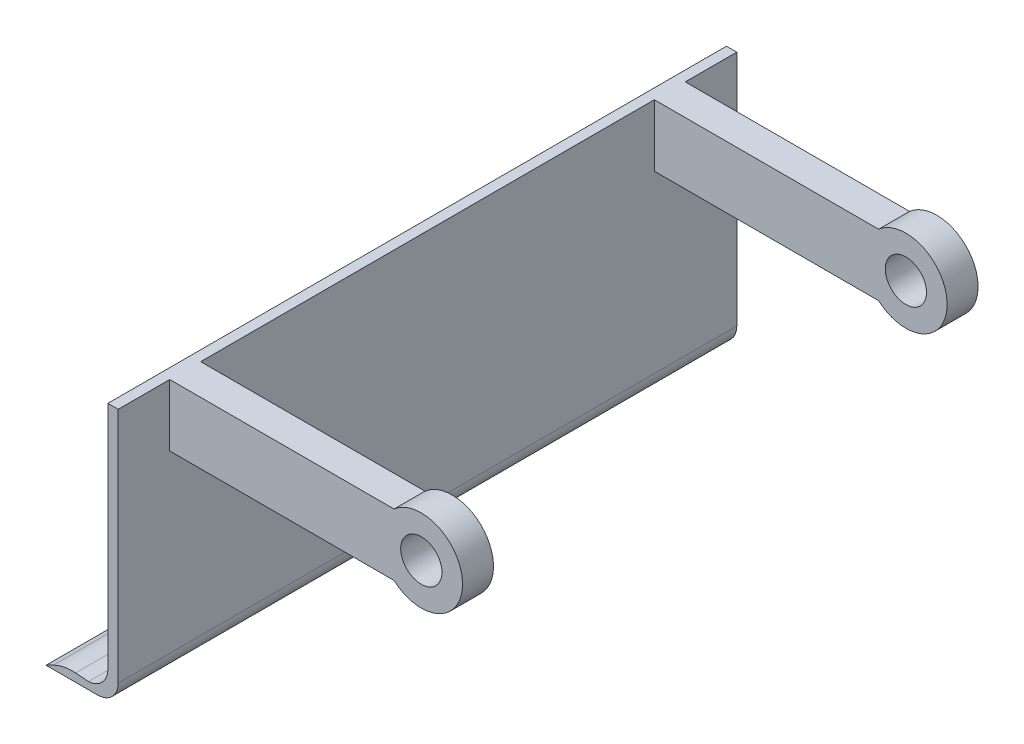
ISO-10303-21;
HEADER;
FILE_DESCRIPTION(('STEP AP214'),'2;1');
FILE_NAME('part.step','',(''),(''),'','','');
FILE_SCHEMA(('AUTOMOTIVE_DESIGN { 1 0 10303 214 1 1 1 1 }'));
ENDSEC;
DATA;
#1=APPLICATION_CONTEXT('core data for automotive mechanical design processes');
#2=APPLICATION_PROTOCOL_DEFINITION('international standard','automotive_design',2000,#1);
#3=PRODUCT_CONTEXT('',#1,'mechanical');
#4=PRODUCT('Part','Part','',(#3));
#5=PRODUCT_RELATED_PRODUCT_CATEGORY('part','',(#4));
#6=PRODUCT_DEFINITION_FORMATION('','',#4);
#7=PRODUCT_DEFINITION_CONTEXT('part definition',#1,'design');
#8=PRODUCT_DEFINITION('design','',#6,#7);
#9=PRODUCT_DEFINITION_SHAPE('','',#8);
#10=(LENGTH_UNIT() NAMED_UNIT(*) SI_UNIT(.MILLI.,.METRE.));
#11=(NAMED_UNIT(*) PLANE_ANGLE_UNIT() SI_UNIT($,.RADIAN.));
#12=(NAMED_UNIT(*) SI_UNIT($,.STERADIAN.) SOLID_ANGLE_UNIT());
#13=UNCERTAINTY_MEASURE_WITH_UNIT(LENGTH_MEASURE(1.E-05),#10,'distance_accuracy_value','');
#14=(GEOMETRIC_REPRESENTATION_CONTEXT(3) GLOBAL_UNCERTAINTY_ASSIGNED_CONTEXT((#13)) GLOBAL_UNIT_ASSIGNED_CONTEXT((#10,
#11,#12)) REPRESENTATION_CONTEXT('',''));
#15=CARTESIAN_POINT('',(0.,0.,0.));
#16=DIRECTION('',(0.,0.,1.));
#17=DIRECTION('',(1.,0.,0.));
#18=AXIS2_PLACEMENT_3D('',#15,#16,#17);
#19=CARTESIAN_POINT('',(0.,0.,300.));
#20=DIRECTION('',(-1.,0.,0.));
#21=DIRECTION('',(0.,0.,1.));
#22=AXIS2_PLACEMENT_3D('',#19,#20,#21);
#23=PLANE('',#22);
#24=DIRECTION('',(0.,-1.,0.));
#25=VECTOR('',#24,1.);
#26=CARTESIAN_POINT('',(0.,125.,40.));
#27=LINE('',#26,#25);
#28=CARTESIAN_POINT('',(0.,125.,40.));
#29=VERTEX_POINT('',#28);
#30=CARTESIAN_POINT('',(0.,95.,39.9999999999999));
#31=VERTEX_POINT('',#30);
#32=EDGE_CURVE('E165',#29,#31,#27,.T.);
#33=ORIENTED_EDGE('',*,*,#32,.F.);
#34=DIRECTION('',(0.,0.,-1.));
#35=VECTOR('',#34,1.);
#36=CARTESIAN_POINT('',(0.,125.,300.));
#37=LINE('',#36,#35);
#38=CARTESIAN_POINT('',(0.,125.,260.));
#39=VERTEX_POINT('',#38);
#40=EDGE_CURVE('E248',#39,#29,#37,.T.);
#41=ORIENTED_EDGE('',*,*,#40,.F.);
#42=DIRECTION('',(0.,1.,0.));
#43=VECTOR('',#42,1.);
#44=CARTESIAN_POINT('',(0.,125.,260.));
#45=LINE('',#44,#43);
#46=CARTESIAN_POINT('',(0.,95.,260.));
#47=VERTEX_POINT('',#46);
#48=EDGE_CURVE('E161',#47,#39,#45,.T.);
#49=ORIENTED_EDGE('',*,*,#48,.F.);
#50=DIRECTION('',(0.,0.,-1.));
#51=VECTOR('',#50,1.);
#52=CARTESIAN_POINT('',(0.,95.,260.));
#53=LINE('',#52,#51);
#54=CARTESIAN_POINT('',(0.,95.,275.));
#55=VERTEX_POINT('',#54);
#56=EDGE_CURVE('E187',#55,#47,#53,.T.);
#57=ORIENTED_EDGE('',*,*,#56,.F.);
#58=DIRECTION('',(0.,-1.,0.));
#59=VECTOR('',#58,1.);
#60=CARTESIAN_POINT('',(0.,125.,275.));
#61=LINE('',#60,#59);
#62=CARTESIAN_POINT('',(0.,125.,275.));
#63=VERTEX_POINT('',#62);
#64=EDGE_CURVE('E184',#63,#55,#61,.T.);
#65=ORIENTED_EDGE('',*,*,#64,.F.);
#66=CARTESIAN_POINT('',(0.,125.,300.));
#67=VERTEX_POINT('',#66);
#68=EDGE_CURVE('E244',#67,#63,#37,.T.);
#69=ORIENTED_EDGE('',*,*,#68,.F.);
#70=DIRECTION('',(0.,1.,0.));
#71=VECTOR('',#70,1.);
#72=CARTESIAN_POINT('',(0.,0.,300.));
#73=LINE('',#72,#71);
#74=CARTESIAN_POINT('',(0.,10.0000000000001,300.));
#75=VERTEX_POINT('',#74);
#76=EDGE_CURVE('E216',#75,#67,#73,.T.);
#77=ORIENTED_EDGE('',*,*,#76,.F.);
#78=DIRECTION('',(0.,0.,-1.));
#79=VECTOR('',#78,1.);
#80=CARTESIAN_POINT('',(0.,10.0000000000001,300.));
#81=LINE('',#80,#79);
#82=CARTESIAN_POINT('',(0.,10.0000000000001,0.));
#83=VERTEX_POINT('',#82);
#84=EDGE_CURVE('E247',#75,#83,#81,.T.);
#85=ORIENTED_EDGE('',*,*,#84,.T.);
#86=DIRECTION('',(0.,1.,0.));
#87=VECTOR('',#86,1.);
#88=CARTESIAN_POINT('',(0.,0.,0.));
#89=LINE('',#88,#87);
#90=CARTESIAN_POINT('',(0.,125.,0.));
#91=VERTEX_POINT('',#90);
#92=EDGE_CURVE('E237',#83,#91,#89,.T.);
#93=ORIENTED_EDGE('',*,*,#92,.T.);
#94=CARTESIAN_POINT('',(0.,125.,25.));
#95=VERTEX_POINT('',#94);
#96=EDGE_CURVE('E243',#95,#91,#37,.T.);
#97=ORIENTED_EDGE('',*,*,#96,.F.);
#98=DIRECTION('',(0.,1.,0.));
#99=VECTOR('',#98,1.);
#100=CARTESIAN_POINT('',(0.,125.,25.));
#101=LINE('',#100,#99);
#102=CARTESIAN_POINT('',(0.,95.,25.));
#103=VERTEX_POINT('',#102);
#104=EDGE_CURVE('E173',#103,#95,#101,.T.);
#105=ORIENTED_EDGE('',*,*,#104,.F.);
#106=DIRECTION('',(0.,0.,-1.));
#107=VECTOR('',#106,1.);
#108=CARTESIAN_POINT('',(0.,95.,39.9999999999999));
#109=LINE('',#108,#107);
#110=EDGE_CURVE('E156',#31,#103,#109,.T.);
#111=ORIENTED_EDGE('',*,*,#110,.F.);
#112=EDGE_LOOP('',(#33,#41,#49,#57,#65,#69,#77,#85,#93,#97,#105,#111));
#113=FACE_BOUND('',#112,.T.);
#114=ADVANCED_FACE('F35',(#113),#23,.F.);
#115=CARTESIAN_POINT('',(-5.,0.,300.));
#116=DIRECTION('',(1.,0.,0.));
#117=DIRECTION('',(0.,1.,0.));
#118=AXIS2_PLACEMENT_3D('',#115,#116,#117);
#119=PLANE('',#118);
#120=DIRECTION('',(0.,-1.,0.));
#121=VECTOR('',#120,1.);
#122=CARTESIAN_POINT('',(-5.,0.,0.));
#123=LINE('',#122,#121);
#124=CARTESIAN_POINT('',(-5.,125.,0.));
#125=VERTEX_POINT('',#124);
#126=CARTESIAN_POINT('',(-5.,13.4179912743919,0.));
#127=VERTEX_POINT('',#126);
#128=EDGE_CURVE('E198',#125,#127,#123,.T.);
#129=ORIENTED_EDGE('',*,*,#128,.T.);
#130=DIRECTION('',(0.,0.,-1.));
#131=VECTOR('',#130,1.);
#132=CARTESIAN_POINT('',(-5.,13.4179912743919,300.));
#133=LINE('',#132,#131);
#134=CARTESIAN_POINT('',(-5.,13.4179912743919,300.));
#135=VERTEX_POINT('',#134);
#136=EDGE_CURVE('E44',#135,#127,#133,.T.);
#137=ORIENTED_EDGE('',*,*,#136,.F.);
#138=DIRECTION('',(0.,-1.,0.));
#139=VECTOR('',#138,1.);
#140=CARTESIAN_POINT('',(-5.,0.,300.));
#141=LINE('',#140,#139);
#142=CARTESIAN_POINT('',(-5.,125.,300.));
#143=VERTEX_POINT('',#142);
#144=EDGE_CURVE('E199',#143,#135,#141,.T.);
#145=ORIENTED_EDGE('',*,*,#144,.F.);
#146=DIRECTION('',(0.,0.,-1.));
#147=VECTOR('',#146,1.);
#148=CARTESIAN_POINT('',(-5.,125.,300.));
#149=LINE('',#148,#147);
#150=EDGE_CURVE('E220',#143,#125,#149,.T.);
#151=ORIENTED_EDGE('',*,*,#150,.T.);
#152=EDGE_LOOP('',(#129,#137,#145,#151));
#153=FACE_BOUND('',#152,.T.);
#154=ADVANCED_FACE('F37',(#153),#119,.F.);
#155=CARTESIAN_POINT('',(-15.,13.4179912743919,300.));
#156=DIRECTION('',(0.,0.,-1.));
#157=DIRECTION('',(-1.,0.,0.));
#158=AXIS2_PLACEMENT_3D('',#155,#156,#157);
#159=CYLINDRICAL_SURFACE('',#158,10.);
#160=CARTESIAN_POINT('',(-15.,13.4179912743919,0.));
#161=DIRECTION('',(0.,0.,1.));
#162=DIRECTION('',(1.,0.,0.));
#163=AXIS2_PLACEMENT_3D('',#160,#161,#162);
#164=CIRCLE('',#163,10.);
#165=CARTESIAN_POINT('',(-14.3870107387115,3.43679674840729,0.));
#166=VERTEX_POINT('',#165);
#167=EDGE_CURVE('E223',#127,#166,#164,.F.);
#168=ORIENTED_EDGE('',*,*,#167,.T.);
#169=DIRECTION('',(0.,0.,-1.));
#170=VECTOR('',#169,1.);
#171=CARTESIAN_POINT('',(-14.3870107387115,3.43679674840729,300.));
#172=LINE('',#171,#170);
#173=CARTESIAN_POINT('',(-14.3870107387115,3.43679674840729,300.));
#174=VERTEX_POINT('',#173);
#175=EDGE_CURVE('E261',#174,#166,#172,.T.);
#176=ORIENTED_EDGE('',*,*,#175,.F.);
#177=CARTESIAN_POINT('',(-15.,13.4179912743919,300.));
#178=DIRECTION('',(0.,0.,1.));
#179=DIRECTION('',(1.,0.,0.));
#180=AXIS2_PLACEMENT_3D('',#177,#178,#179);
#181=CIRCLE('',#180,10.);
#182=EDGE_CURVE('E202',#135,#174,#181,.F.);
#183=ORIENTED_EDGE('',*,*,#182,.F.);
#184=ORIENTED_EDGE('',*,*,#136,.T.);
#185=EDGE_LOOP('',(#168,#176,#183,#184));
#186=FACE_BOUND('',#185,.T.);
#187=ADVANCED_FACE('F267',(#186),#159,.F.);
#188=CARTESIAN_POINT('',(0.186203973970404,2.20758390080925,300.));
#189=DIRECTION('',(-0.0840489526757902,-0.996461626734368,0.));
#190=DIRECTION('',(0.996461626734368,-0.0840489526757902,0.));
#191=AXIS2_PLACEMENT_3D('',#188,#189,#190);
#192=PLANE('',#191);
#193=DIRECTION('',(-0.996461626734368,0.0840489526757902,0.));
#194=VECTOR('',#193,1.);
#195=CARTESIAN_POINT('',(0.186203973970404,2.20758390080925,0.));
#196=LINE('',#195,#194);
#197=CARTESIAN_POINT('',(-20.619947117888,3.96252875926402,0.));
#198=VERTEX_POINT('',#197);
#199=EDGE_CURVE('E225',#166,#198,#196,.T.);
#200=ORIENTED_EDGE('',*,*,#199,.T.);
#201=DIRECTION('',(0.,0.,-1.));
#202=VECTOR('',#201,1.);
#203=CARTESIAN_POINT('',(-20.619947117888,3.96252875926402,300.));
#204=LINE('',#203,#202);
#205=CARTESIAN_POINT('',(-20.619947117888,3.96252875926402,300.));
#206=VERTEX_POINT('',#205);
#207=EDGE_CURVE('E259',#206,#198,#204,.T.);
#208=ORIENTED_EDGE('',*,*,#207,.F.);
#209=DIRECTION('',(-0.996461626734368,0.0840489526757902,0.));
#210=VECTOR('',#209,1.);
#211=CARTESIAN_POINT('',(0.186203973970404,2.20758390080925,300.));
#212=LINE('',#211,#210);
#213=EDGE_CURVE('E205',#174,#206,#212,.T.);
#214=ORIENTED_EDGE('',*,*,#213,.F.);
#215=ORIENTED_EDGE('',*,*,#175,.T.);
#216=EDGE_LOOP('',(#200,#208,#214,#215));
#217=FACE_BOUND('',#216,.T.);
#218=ADVANCED_FACE('F282',(#217),#192,.F.);
#219=CARTESIAN_POINT('',(-22.3009261714039,-15.9667037754233,300.));
#220=DIRECTION('',(0.,0.,-1.));
#221=DIRECTION('',(-1.,0.,0.));
#222=AXIS2_PLACEMENT_3D('',#219,#220,#221);
#223=CYLINDRICAL_SURFACE('',#222,20.);
#224=CARTESIAN_POINT('',(-22.3009261714039,-15.9667037754233,0.));
#225=DIRECTION('',(0.,0.,1.));
#226=DIRECTION('',(1.,0.,0.));
#227=AXIS2_PLACEMENT_3D('',#224,#225,#226);
#228=CIRCLE('',#227,20.);
#229=CARTESIAN_POINT('',(-31.4172931870261,1.83475269410396,0.));
#230=VERTEX_POINT('',#229);
#231=EDGE_CURVE('E228',#230,#198,#228,.F.);
#232=ORIENTED_EDGE('',*,*,#231,.F.);
#233=DIRECTION('',(0.,0.,-1.));
#234=VECTOR('',#233,1.);
#235=CARTESIAN_POINT('',(-31.4172931870261,1.83475269410396,300.));
#236=LINE('',#235,#234);
#237=CARTESIAN_POINT('',(-31.4172931870261,1.83475269410396,300.));
#238=VERTEX_POINT('',#237);
#239=EDGE_CURVE('E257',#238,#230,#236,.T.);
#240=ORIENTED_EDGE('',*,*,#239,.F.);
#241=CARTESIAN_POINT('',(-22.3009261714039,-15.9667037754233,300.));
#242=DIRECTION('',(0.,0.,1.));
#243=DIRECTION('',(1.,0.,0.));
#244=AXIS2_PLACEMENT_3D('',#241,#242,#243);
#245=CIRCLE('',#244,20.);
#246=EDGE_CURVE('E207',#238,#206,#245,.F.);
#247=ORIENTED_EDGE('',*,*,#246,.T.);
#248=ORIENTED_EDGE('',*,*,#207,.T.);
#249=EDGE_LOOP('',(#232,#240,#247,#248));
#250=FACE_BOUND('',#249,.T.);
#251=ADVANCED_FACE('F307',(#250),#223,.T.);
#252=CARTESIAN_POINT('',(-7.27196291180832,14.1999034265229,300.));
#253=DIRECTION('',(0.455818350781108,-0.890072823476366,0.));
#254=DIRECTION('',(0.890072823476366,0.455818350781108,0.));
#255=AXIS2_PLACEMENT_3D('',#252,#253,#254);
#256=PLANE('',#255);
#257=DIRECTION('',(-0.890072823476367,-0.455818350781108,0.));
#258=VECTOR('',#257,1.);
#259=CARTESIAN_POINT('',(-7.27196291180832,14.1999034265229,0.));
#260=LINE('',#259,#258);
#261=CARTESIAN_POINT('',(-35.,0.,0.));
#262=VERTEX_POINT('',#261);
#263=EDGE_CURVE('E231',#230,#262,#260,.T.);
#264=ORIENTED_EDGE('',*,*,#263,.T.);
#265=DIRECTION('',(0.,0.,-1.));
#266=VECTOR('',#265,1.);
#267=CARTESIAN_POINT('',(-35.,0.,300.));
#268=LINE('',#267,#266);
#269=CARTESIAN_POINT('',(-35.,0.,300.));
#270=VERTEX_POINT('',#269);
#271=EDGE_CURVE('E254',#270,#262,#268,.T.);
#272=ORIENTED_EDGE('',*,*,#271,.F.);
#273=DIRECTION('',(-0.890072823476367,-0.455818350781108,0.));
#274=VECTOR('',#273,1.);
#275=CARTESIAN_POINT('',(-7.27196291180832,14.1999034265229,300.));
#276=LINE('',#275,#274);
#277=EDGE_CURVE('E210',#238,#270,#276,.T.);
#278=ORIENTED_EDGE('',*,*,#277,.F.);
#279=ORIENTED_EDGE('',*,*,#239,.T.);
#280=EDGE_LOOP('',(#264,#272,#278,#279));
#281=FACE_BOUND('',#280,.T.);
#282=ADVANCED_FACE('F305',(#281),#256,.F.);
#283=CARTESIAN_POINT('',(0.,0.,300.));
#284=DIRECTION('',(0.,1.,0.));
#285=DIRECTION('',(0.,0.,1.));
#286=AXIS2_PLACEMENT_3D('',#283,#284,#285);
#287=PLANE('',#286);
#288=DIRECTION('',(1.,0.,0.));
#289=VECTOR('',#288,1.);
#290=CARTESIAN_POINT('',(0.,0.,0.));
#291=LINE('',#290,#289);
#292=CARTESIAN_POINT('',(-10.0000000000001,0.,0.));
#293=VERTEX_POINT('',#292);
#294=EDGE_CURVE('E233',#262,#293,#291,.T.);
#295=ORIENTED_EDGE('',*,*,#294,.T.);
#296=DIRECTION('',(0.,0.,-1.));
#297=VECTOR('',#296,1.);
#298=CARTESIAN_POINT('',(-10.0000000000001,0.,300.));
#299=LINE('',#298,#297);
#300=CARTESIAN_POINT('',(-10.0000000000001,0.,300.));
#301=VERTEX_POINT('',#300);
#302=EDGE_CURVE('E251',#301,#293,#299,.T.);
#303=ORIENTED_EDGE('',*,*,#302,.F.);
#304=DIRECTION('',(1.,0.,0.));
#305=VECTOR('',#304,1.);
#306=CARTESIAN_POINT('',(0.,0.,300.));
#307=LINE('',#306,#305);
#308=EDGE_CURVE('E212',#270,#301,#307,.T.);
#309=ORIENTED_EDGE('',*,*,#308,.F.);
#310=ORIENTED_EDGE('',*,*,#271,.T.);
#311=EDGE_LOOP('',(#295,#303,#309,#310));
#312=FACE_BOUND('',#311,.T.);
#313=ADVANCED_FACE('F301',(#312),#287,.F.);
#314=CARTESIAN_POINT('',(-10.,10.,300.));
#315=DIRECTION('',(0.,0.,-1.));
#316=DIRECTION('',(-1.,0.,0.));
#317=AXIS2_PLACEMENT_3D('',#314,#315,#316);
#318=CYLINDRICAL_SURFACE('',#317,10.);
#319=CARTESIAN_POINT('',(-10.,10.,0.));
#320=DIRECTION('',(0.,0.,1.));
#321=DIRECTION('',(1.,0.,0.));
#322=AXIS2_PLACEMENT_3D('',#319,#320,#321);
#323=CIRCLE('',#322,10.);
#324=EDGE_CURVE('E235',#293,#83,#323,.T.);
#325=ORIENTED_EDGE('',*,*,#324,.T.);
#326=ORIENTED_EDGE('',*,*,#84,.F.);
#327=CARTESIAN_POINT('',(-10.,10.,300.));
#328=DIRECTION('',(0.,0.,1.));
#329=DIRECTION('',(1.,0.,0.));
#330=AXIS2_PLACEMENT_3D('',#327,#328,#329);
#331=CIRCLE('',#330,10.);
#332=EDGE_CURVE('E214',#301,#75,#331,.T.);
#333=ORIENTED_EDGE('',*,*,#332,.F.);
#334=ORIENTED_EDGE('',*,*,#302,.T.);
#335=EDGE_LOOP('',(#325,#326,#333,#334));
#336=FACE_BOUND('',#335,.T.);
#337=ADVANCED_FACE('F296',(#336),#318,.T.);
#338=CARTESIAN_POINT('',(0.,125.,300.));
#339=DIRECTION('',(0.,-1.,0.));
#340=DIRECTION('',(0.,0.,-1.));
#341=AXIS2_PLACEMENT_3D('',#338,#339,#340);
#342=PLANE('',#341);
#343=DIRECTION('',(-1.,0.,0.));
#344=VECTOR('',#343,1.);
#345=CARTESIAN_POINT('',(115.,125.,40.));
#346=LINE('',#345,#344);
#347=CARTESIAN_POINT('',(108.771243444677,125.,40.));
#348=VERTEX_POINT('',#347);
#349=EDGE_CURVE('E51',#348,#29,#346,.T.);
#350=ORIENTED_EDGE('',*,*,#349,.F.);
#351=DIRECTION('',(0.,0.,1.));
#352=VECTOR('',#351,1.);
#353=CARTESIAN_POINT('',(108.771243444677,125.,-31.5685424949238));
#354=LINE('',#353,#352);
#355=CARTESIAN_POINT('',(108.771243444677,125.,25.));
#356=VERTEX_POINT('',#355);
#357=EDGE_CURVE('E533',#348,#356,#354,.F.);
#358=ORIENTED_EDGE('',*,*,#357,.T.);
#359=DIRECTION('',(-1.,0.,0.));
#360=VECTOR('',#359,1.);
#361=CARTESIAN_POINT('',(115.,125.,25.));
#362=LINE('',#361,#360);
#363=EDGE_CURVE('E179',#356,#95,#362,.T.);
#364=ORIENTED_EDGE('',*,*,#363,.T.);
#365=ORIENTED_EDGE('',*,*,#96,.T.);
#366=DIRECTION('',(-1.,0.,0.));
#367=VECTOR('',#366,1.);
#368=CARTESIAN_POINT('',(0.,125.,0.));
#369=LINE('',#368,#367);
#370=EDGE_CURVE('E203',#91,#125,#369,.T.);
#371=ORIENTED_EDGE('',*,*,#370,.T.);
#372=ORIENTED_EDGE('',*,*,#150,.F.);
#373=DIRECTION('',(-1.,0.,0.));
#374=VECTOR('',#373,1.);
#375=CARTESIAN_POINT('',(0.,125.,300.));
#376=LINE('',#375,#374);
#377=EDGE_CURVE('E218',#67,#143,#376,.T.);
#378=ORIENTED_EDGE('',*,*,#377,.F.);
#379=ORIENTED_EDGE('',*,*,#68,.T.);
#380=DIRECTION('',(-1.,0.,0.));
#381=VECTOR('',#380,1.);
#382=CARTESIAN_POINT('',(115.,125.,275.));
#383=LINE('',#382,#381);
#384=CARTESIAN_POINT('',(108.771243444678,125.,275.));
#385=VERTEX_POINT('',#384);
#386=EDGE_CURVE('E194',#385,#63,#383,.T.);
#387=ORIENTED_EDGE('',*,*,#386,.F.);
#388=DIRECTION('',(0.,0.,1.));
#389=VECTOR('',#388,1.);
#390=CARTESIAN_POINT('',(108.771243444678,125.,203.431457505076));
#391=LINE('',#390,#389);
#392=CARTESIAN_POINT('',(108.771243444678,125.,260.));
#393=VERTEX_POINT('',#392);
#394=EDGE_CURVE('E169',#385,#393,#391,.F.);
#395=ORIENTED_EDGE('',*,*,#394,.T.);
#396=DIRECTION('',(-1.,0.,0.));
#397=VECTOR('',#396,1.);
#398=CARTESIAN_POINT('',(115.,125.,260.));
#399=LINE('',#398,#397);
#400=EDGE_CURVE('E196',#393,#39,#399,.T.);
#401=ORIENTED_EDGE('',*,*,#400,.T.);
#402=ORIENTED_EDGE('',*,*,#40,.T.);
#403=EDGE_LOOP('',(#350,#358,#364,#365,#371,#372,#378,#379,#387,#395,#401,#402));
#404=FACE_BOUND('',#403,.T.);
#405=ADVANCED_FACE('F290',(#404),#342,.F.);
#406=CARTESIAN_POINT('',(0.,0.,300.));
#407=DIRECTION('',(0.,0.,1.));
#408=DIRECTION('',(1.,0.,0.));
#409=AXIS2_PLACEMENT_3D('',#406,#407,#408);
#410=PLANE('',#409);
#411=ORIENTED_EDGE('',*,*,#144,.T.);
#412=ORIENTED_EDGE('',*,*,#182,.T.);
#413=ORIENTED_EDGE('',*,*,#213,.T.);
#414=ORIENTED_EDGE('',*,*,#246,.F.);
#415=ORIENTED_EDGE('',*,*,#277,.T.);
#416=ORIENTED_EDGE('',*,*,#308,.T.);
#417=ORIENTED_EDGE('',*,*,#332,.T.);
#418=ORIENTED_EDGE('',*,*,#76,.T.);
#419=ORIENTED_EDGE('',*,*,#377,.T.);
#420=EDGE_LOOP('',(#411,#412,#413,#414,#415,#416,#417,#418,#419));
#421=FACE_BOUND('',#420,.T.);
#422=ADVANCED_FACE('F286',(#421),#410,.T.);
#423=CARTESIAN_POINT('',(0.,0.,0.));
#424=DIRECTION('',(0.,0.,1.));
#425=DIRECTION('',(1.,0.,0.));
#426=AXIS2_PLACEMENT_3D('',#423,#424,#425);
#427=PLANE('',#426);
#428=ORIENTED_EDGE('',*,*,#128,.F.);
#429=ORIENTED_EDGE('',*,*,#370,.F.);
#430=ORIENTED_EDGE('',*,*,#92,.F.);
#431=ORIENTED_EDGE('',*,*,#324,.F.);
#432=ORIENTED_EDGE('',*,*,#294,.F.);
#433=ORIENTED_EDGE('',*,*,#263,.F.);
#434=ORIENTED_EDGE('',*,*,#231,.T.);
#435=ORIENTED_EDGE('',*,*,#199,.F.);
#436=ORIENTED_EDGE('',*,*,#167,.F.);
#437=EDGE_LOOP('',(#428,#429,#430,#431,#432,#433,#434,#435,#436));
#438=FACE_BOUND('',#437,.T.);
#439=ADVANCED_FACE('F275',(#438),#427,.F.);
#440=CARTESIAN_POINT('',(115.,125.,260.));
#441=DIRECTION('',(0.,0.,1.));
#442=DIRECTION('',(1.,0.,0.));
#443=AXIS2_PLACEMENT_3D('',#440,#441,#442);
#444=PLANE('',#443);
#445=CARTESIAN_POINT('',(122.,109.999999999999,260.));
#446=DIRECTION('',(0.,0.,1.));
#447=DIRECTION('',(1.,0.,0.));
#448=AXIS2_PLACEMENT_3D('',#445,#446,#447);
#449=CIRCLE('',#448,10.);
#450=CARTESIAN_POINT('',(132.,109.999999999999,260.));
#451=VERTEX_POINT('',#450);
#452=EDGE_CURVE('E520',#451,#451,#449,.T.);
#453=ORIENTED_EDGE('',*,*,#452,.T.);
#454=EDGE_LOOP('',(#453));
#455=FACE_BOUND('',#454,.T.);
#456=ORIENTED_EDGE('',*,*,#400,.F.);
#457=CARTESIAN_POINT('',(122.,109.999999999999,260.));
#458=DIRECTION('',(0.,0.,1.));
#459=DIRECTION('',(1.,0.,0.));
#460=AXIS2_PLACEMENT_3D('',#457,#458,#459);
#461=CIRCLE('',#460,20.);
#462=CARTESIAN_POINT('',(108.771243444676,95.,260.));
#463=VERTEX_POINT('',#462);
#464=EDGE_CURVE('E538',#393,#463,#461,.F.);
#465=ORIENTED_EDGE('',*,*,#464,.T.);
#466=DIRECTION('',(-1.,0.,0.));
#467=VECTOR('',#466,1.);
#468=CARTESIAN_POINT('',(115.,95.,260.));
#469=LINE('',#468,#467);
#470=EDGE_CURVE('E190',#463,#47,#469,.T.);
#471=ORIENTED_EDGE('',*,*,#470,.T.);
#472=ORIENTED_EDGE('',*,*,#48,.T.);
#473=EDGE_LOOP('',(#456,#465,#471,#472));
#474=FACE_BOUND('',#473,.T.);
#475=ADVANCED_FACE('F354',(#455,#474),#444,.F.);
#476=CARTESIAN_POINT('',(115.,125.,275.));
#477=DIRECTION('',(0.,0.,-1.));
#478=DIRECTION('',(-1.,0.,0.));
#479=AXIS2_PLACEMENT_3D('',#476,#477,#478);
#480=PLANE('',#479);
#481=CARTESIAN_POINT('',(122.,109.999999999999,275.));
#482=DIRECTION('',(0.,0.,1.));
#483=DIRECTION('',(1.,0.,0.));
#484=AXIS2_PLACEMENT_3D('',#481,#482,#483);
#485=CIRCLE('',#484,10.);
#486=CARTESIAN_POINT('',(132.,109.999999999999,275.));
#487=VERTEX_POINT('',#486);
#488=EDGE_CURVE('E517',#487,#487,#485,.T.);
#489=ORIENTED_EDGE('',*,*,#488,.F.);
#490=EDGE_LOOP('',(#489));
#491=FACE_BOUND('',#490,.T.);
#492=CARTESIAN_POINT('',(122.,109.999999999999,275.));
#493=DIRECTION('',(0.,0.,1.));
#494=DIRECTION('',(1.,0.,0.));
#495=AXIS2_PLACEMENT_3D('',#492,#493,#494);
#496=CIRCLE('',#495,20.);
#497=CARTESIAN_POINT('',(108.771243444676,95.,275.));
#498=VERTEX_POINT('',#497);
#499=EDGE_CURVE('E535',#498,#385,#496,.T.);
#500=ORIENTED_EDGE('',*,*,#499,.T.);
#501=ORIENTED_EDGE('',*,*,#386,.T.);
#502=ORIENTED_EDGE('',*,*,#64,.T.);
#503=DIRECTION('',(-1.,0.,0.));
#504=VECTOR('',#503,1.);
#505=CARTESIAN_POINT('',(115.,95.,275.));
#506=LINE('',#505,#504);
#507=EDGE_CURVE('E192',#498,#55,#506,.T.);
#508=ORIENTED_EDGE('',*,*,#507,.F.);
#509=EDGE_LOOP('',(#500,#501,#502,#508));
#510=FACE_BOUND('',#509,.T.);
#511=ADVANCED_FACE('F360',(#491,#510),#480,.F.);
#512=CARTESIAN_POINT('',(115.,95.,260.));
#513=DIRECTION('',(0.,1.,0.));
#514=DIRECTION('',(0.,0.,1.));
#515=AXIS2_PLACEMENT_3D('',#512,#513,#514);
#516=PLANE('',#515);
#517=ORIENTED_EDGE('',*,*,#470,.F.);
#518=DIRECTION('',(0.,0.,1.));
#519=VECTOR('',#518,1.);
#520=CARTESIAN_POINT('',(108.771243444676,95.0000000000001,203.431457505076));
#521=LINE('',#520,#519);
#522=EDGE_CURVE('E11',#463,#498,#521,.T.);
#523=ORIENTED_EDGE('',*,*,#522,.T.);
#524=ORIENTED_EDGE('',*,*,#507,.T.);
#525=ORIENTED_EDGE('',*,*,#56,.T.);
#526=EDGE_LOOP('',(#517,#523,#524,#525));
#527=FACE_BOUND('',#526,.T.);
#528=ADVANCED_FACE('F369',(#527),#516,.F.);
#529=CARTESIAN_POINT('',(115.,125.,40.));
#530=DIRECTION('',(0.,0.,-1.));
#531=DIRECTION('',(0.,1.,0.));
#532=AXIS2_PLACEMENT_3D('',#529,#530,#531);
#533=PLANE('',#532);
#534=CARTESIAN_POINT('',(122.,109.999999999999,40.));
#535=DIRECTION('',(0.,0.,-1.));
#536=DIRECTION('',(0.,1.,0.));
#537=AXIS2_PLACEMENT_3D('',#534,#535,#536);
#538=CIRCLE('',#537,10.);
#539=CARTESIAN_POINT('',(122.,120.,40.));
#540=VERTEX_POINT('',#539);
#541=EDGE_CURVE('E522',#540,#540,#538,.T.);
#542=ORIENTED_EDGE('',*,*,#541,.T.);
#543=EDGE_LOOP('',(#542));
#544=FACE_BOUND('',#543,.T.);
#545=CARTESIAN_POINT('',(122.,110.,39.9999999999998));
#546=DIRECTION('',(0.,0.,1.));
#547=DIRECTION('',(1.,0.,0.));
#548=AXIS2_PLACEMENT_3D('',#545,#546,#547);
#549=CIRCLE('',#548,20.);
#550=CARTESIAN_POINT('',(108.771243444677,95.,39.9999999999999));
#551=VERTEX_POINT('',#550);
#552=EDGE_CURVE('E521',#551,#348,#549,.T.);
#553=ORIENTED_EDGE('',*,*,#552,.T.);
#554=ORIENTED_EDGE('',*,*,#349,.T.);
#555=ORIENTED_EDGE('',*,*,#32,.T.);
#556=DIRECTION('',(-1.,0.,0.));
#557=VECTOR('',#556,1.);
#558=CARTESIAN_POINT('',(115.,95.,39.9999999999999));
#559=LINE('',#558,#557);
#560=EDGE_CURVE('E152',#551,#31,#559,.T.);
#561=ORIENTED_EDGE('',*,*,#560,.F.);
#562=EDGE_LOOP('',(#553,#554,#555,#561));
#563=FACE_BOUND('',#562,.T.);
#564=ADVANCED_FACE('F166',(#544,#563),#533,.F.);
#565=CARTESIAN_POINT('',(115.,95.,39.9999999999999));
#566=DIRECTION('',(0.,1.,0.));
#567=DIRECTION('',(0.,0.,1.));
#568=AXIS2_PLACEMENT_3D('',#565,#566,#567);
#569=PLANE('',#568);
#570=DIRECTION('',(-1.,0.,0.));
#571=VECTOR('',#570,1.);
#572=CARTESIAN_POINT('',(115.,95.,25.));
#573=LINE('',#572,#571);
#574=CARTESIAN_POINT('',(108.771243444677,95.,25.));
#575=VERTEX_POINT('',#574);
#576=EDGE_CURVE('E162',#575,#103,#573,.T.);
#577=ORIENTED_EDGE('',*,*,#576,.F.);
#578=DIRECTION('',(0.,0.,1.));
#579=VECTOR('',#578,1.);
#580=CARTESIAN_POINT('',(108.771243444677,95.,-31.5685424949238));
#581=LINE('',#580,#579);
#582=EDGE_CURVE('E59',#575,#551,#581,.T.);
#583=ORIENTED_EDGE('',*,*,#582,.T.);
#584=ORIENTED_EDGE('',*,*,#560,.T.);
#585=ORIENTED_EDGE('',*,*,#110,.T.);
#586=EDGE_LOOP('',(#577,#583,#584,#585));
#587=FACE_BOUND('',#586,.T.);
#588=ADVANCED_FACE('F154',(#587),#569,.F.);
#589=CARTESIAN_POINT('',(115.,125.,25.));
#590=DIRECTION('',(0.,0.,1.));
#591=DIRECTION('',(0.,-1.,0.));
#592=AXIS2_PLACEMENT_3D('',#589,#590,#591);
#593=PLANE('',#592);
#594=CARTESIAN_POINT('',(122.,109.999999999999,25.));
#595=DIRECTION('',(0.,0.,1.));
#596=DIRECTION('',(0.,-1.,0.));
#597=AXIS2_PLACEMENT_3D('',#594,#595,#596);
#598=CIRCLE('',#597,10.);
#599=CARTESIAN_POINT('',(122.,99.9999999999994,25.));
#600=VERTEX_POINT('',#599);
#601=EDGE_CURVE('E39',#600,#600,#598,.T.);
#602=ORIENTED_EDGE('',*,*,#601,.T.);
#603=EDGE_LOOP('',(#602));
#604=FACE_BOUND('',#603,.T.);
#605=ORIENTED_EDGE('',*,*,#363,.F.);
#606=CARTESIAN_POINT('',(122.,110.,25.));
#607=DIRECTION('',(0.,0.,1.));
#608=DIRECTION('',(0.,-1.,0.));
#609=AXIS2_PLACEMENT_3D('',#606,#607,#608);
#610=CIRCLE('',#609,20.);
#611=EDGE_CURVE('E524',#356,#575,#610,.F.);
#612=ORIENTED_EDGE('',*,*,#611,.T.);
#613=ORIENTED_EDGE('',*,*,#576,.T.);
#614=ORIENTED_EDGE('',*,*,#104,.T.);
#615=EDGE_LOOP('',(#605,#612,#613,#614));
#616=FACE_BOUND('',#615,.T.);
#617=ADVANCED_FACE('F391',(#604,#616),#593,.F.);
#618=CARTESIAN_POINT('',(122.,109.999999999999,203.431457505076));
#619=DIRECTION('',(0.,0.,1.));
#620=DIRECTION('',(1.,0.,0.));
#621=AXIS2_PLACEMENT_3D('',#618,#619,#620);
#622=CYLINDRICAL_SURFACE('',#621,20.);
#623=ORIENTED_EDGE('',*,*,#394,.F.);
#624=ORIENTED_EDGE('',*,*,#499,.F.);
#625=ORIENTED_EDGE('',*,*,#522,.F.);
#626=ORIENTED_EDGE('',*,*,#464,.F.);
#627=EDGE_LOOP('',(#623,#624,#625,#626));
#628=FACE_BOUND('',#627,.T.);
#629=ADVANCED_FACE('F397',(#628),#622,.T.);
#630=CARTESIAN_POINT('',(122.,110.,-31.5685424949238));
#631=DIRECTION('',(0.,0.,1.));
#632=DIRECTION('',(1.,0.,0.));
#633=AXIS2_PLACEMENT_3D('',#630,#631,#632);
#634=CYLINDRICAL_SURFACE('',#633,20.);
#635=ORIENTED_EDGE('',*,*,#357,.F.);
#636=ORIENTED_EDGE('',*,*,#552,.F.);
#637=ORIENTED_EDGE('',*,*,#582,.F.);
#638=ORIENTED_EDGE('',*,*,#611,.F.);
#639=EDGE_LOOP('',(#635,#636,#637,#638));
#640=FACE_BOUND('',#639,.T.);
#641=ADVANCED_FACE('F405',(#640),#634,.T.);
#642=CARTESIAN_POINT('',(122.,109.999999999999,0.));
#643=DIRECTION('',(0.,0.,1.));
#644=DIRECTION('',(1.,0.,0.));
#645=AXIS2_PLACEMENT_3D('',#642,#643,#644);
#646=CYLINDRICAL_SURFACE('',#645,10.);
#647=ORIENTED_EDGE('',*,*,#601,.F.);
#648=EDGE_LOOP('',(#647));
#649=FACE_BOUND('',#648,.T.);
#650=ORIENTED_EDGE('',*,*,#541,.F.);
#651=EDGE_LOOP('',(#650));
#652=FACE_BOUND('',#651,.T.);
#653=ADVANCED_FACE('F412',(#649,#652),#646,.F.);
#654=ORIENTED_EDGE('',*,*,#488,.T.);
#655=EDGE_LOOP('',(#654));
#656=FACE_BOUND('',#655,.T.);
#657=ORIENTED_EDGE('',*,*,#452,.F.);
#658=EDGE_LOOP('',(#657));
#659=FACE_BOUND('',#658,.T.);
#660=ADVANCED_FACE('F419',(#656,#659),#646,.F.);
#661=CLOSED_SHELL('',(#114,#154,#187,#218,#251,#282,#313,#337,#405,#422,#439,#475,#511,#528,
#564,#588,#617,#629,#641,#653,#660));
#662=MANIFOLD_SOLID_BREP('B2',#661);
#663=ADVANCED_BREP_SHAPE_REPRESENTATION('',(#18,#662),#14);
#664=SHAPE_DEFINITION_REPRESENTATION(#9,#663);
ENDSEC;
END-ISO-10303-21;
